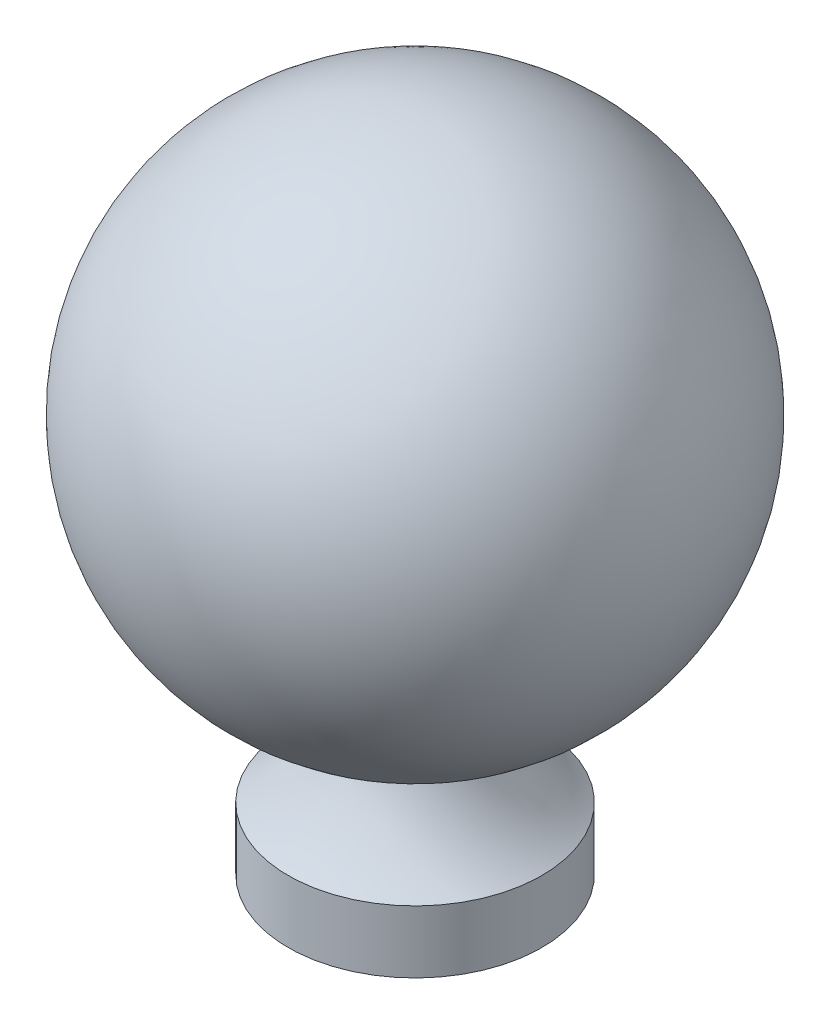
ISO-10303-21;
HEADER;
FILE_DESCRIPTION(('STEP AP214'),'2;1');
FILE_NAME('part.step','',(''),(''),'','','');
FILE_SCHEMA(('AUTOMOTIVE_DESIGN { 1 0 10303 214 1 1 1 1 }'));
ENDSEC;
DATA;
#1=APPLICATION_CONTEXT('core data for automotive mechanical design processes');
#2=APPLICATION_PROTOCOL_DEFINITION('international standard','automotive_design',2000,#1);
#3=PRODUCT_CONTEXT('',#1,'mechanical');
#4=PRODUCT('Part','Part','',(#3));
#5=PRODUCT_RELATED_PRODUCT_CATEGORY('part','',(#4));
#6=PRODUCT_DEFINITION_FORMATION('','',#4);
#7=PRODUCT_DEFINITION_CONTEXT('part definition',#1,'design');
#8=PRODUCT_DEFINITION('design','',#6,#7);
#9=PRODUCT_DEFINITION_SHAPE('','',#8);
#10=(LENGTH_UNIT() NAMED_UNIT(*) SI_UNIT(.MILLI.,.METRE.));
#11=(NAMED_UNIT(*) PLANE_ANGLE_UNIT() SI_UNIT($,.RADIAN.));
#12=(NAMED_UNIT(*) SI_UNIT($,.STERADIAN.) SOLID_ANGLE_UNIT());
#13=UNCERTAINTY_MEASURE_WITH_UNIT(LENGTH_MEASURE(1.E-05),#10,'distance_accuracy_value','');
#14=(GEOMETRIC_REPRESENTATION_CONTEXT(3) GLOBAL_UNCERTAINTY_ASSIGNED_CONTEXT((#13)) GLOBAL_UNIT_ASSIGNED_CONTEXT((#10,
#11,#12)) REPRESENTATION_CONTEXT('',''));
#15=CARTESIAN_POINT('',(0.,0.,0.));
#16=DIRECTION('',(0.,0.,1.));
#17=DIRECTION('',(1.,0.,0.));
#18=AXIS2_PLACEMENT_3D('',#15,#16,#17);
#19=CARTESIAN_POINT('',(0.,8.77,0.));
#20=DIRECTION('',(0.,-1.,0.));
#21=DIRECTION('',(1.,0.,0.));
#22=AXIS2_PLACEMENT_3D('',#19,#20,#21);
#23=SPHERICAL_SURFACE('',#22,5.75);
#24=CARTESIAN_POINT('',(0.,3.23626668356372,0.));
#25=DIRECTION('',(0.,-1.,0.));
#26=DIRECTION('',(0.,0.,-1.));
#27=AXIS2_PLACEMENT_3D('',#24,#25,#26);
#28=CIRCLE('',#27,1.56214454598897);
#29=CARTESIAN_POINT('',(0.,3.23626668356372,-1.56214454598897));
#30=VERTEX_POINT('',#29);
#31=EDGE_CURVE('E10',#30,#30,#28,.T.);
#32=ORIENTED_EDGE('',*,*,#31,.F.);
#33=EDGE_LOOP('',(#32));
#34=FACE_BOUND('',#33,.T.);
#35=ADVANCED_FACE('F31',(#34),#23,.T.);
#36=CARTESIAN_POINT('',(0.,3.18814726342079,0.));
#37=DIRECTION('',(0.,-1.,0.));
#38=DIRECTION('',(0.,0.,-1.));
#39=AXIS2_PLACEMENT_3D('',#36,#37,#38);
#40=TOROIDAL_SURFACE('',#39,1.57572841160626,0.05);
#41=ORIENTED_EDGE('',*,*,#31,.T.);
#42=EDGE_LOOP('',(#41));
#43=FACE_BOUND('',#42,.T.);
#44=CARTESIAN_POINT('',(0.,3.17239921063848,0.));
#45=DIRECTION('',(0.,-1.,0.));
#46=DIRECTION('',(0.,0.,-1.));
#47=AXIS2_PLACEMENT_3D('',#44,#45,#46);
#48=CIRCLE('',#47,1.52827318182528);
#49=CARTESIAN_POINT('',(0.,3.17239921063848,-1.52827318182528));
#50=VERTEX_POINT('',#49);
#51=EDGE_CURVE('E37',#50,#50,#48,.T.);
#52=ORIENTED_EDGE('',*,*,#51,.F.);
#53=EDGE_LOOP('',(#52));
#54=FACE_BOUND('',#53,.T.);
#55=ADVANCED_FACE('F63',(#43,#54),#40,.F.);
#56=CARTESIAN_POINT('',(0.,4.3692512220943,0.));
#57=DIRECTION('',(0.,-1.,0.));
#58=DIRECTION('',(0.,0.,-1.));
#59=AXIS2_PLACEMENT_3D('',#56,#57,#58);
#60=TOROIDAL_SURFACE('',#59,5.13487064517965,3.8);
#61=ORIENTED_EDGE('',*,*,#51,.T.);
#62=EDGE_LOOP('',(#61));
#63=FACE_BOUND('',#62,.T.);
#64=CARTESIAN_POINT('',(0.,1.37508934206401,0.));
#65=DIRECTION('',(0.,-1.,0.));
#66=DIRECTION('',(0.,0.,-1.));
#67=AXIS2_PLACEMENT_3D('',#64,#65,#66);
#68=CIRCLE('',#67,2.795);
#69=CARTESIAN_POINT('',(0.,1.37508934206401,-2.795));
#70=VERTEX_POINT('',#69);
#71=EDGE_CURVE('E41',#70,#70,#68,.T.);
#72=ORIENTED_EDGE('',*,*,#71,.F.);
#73=EDGE_LOOP('',(#72));
#74=FACE_BOUND('',#73,.T.);
#75=ADVANCED_FACE('F55',(#63,#74),#60,.F.);
#76=CARTESIAN_POINT('',(0.,0.,0.));
#77=DIRECTION('',(0.,-1.,0.));
#78=DIRECTION('',(0.,0.,-1.));
#79=AXIS2_PLACEMENT_3D('',#76,#77,#78);
#80=CYLINDRICAL_SURFACE('',#79,2.795);
#81=ORIENTED_EDGE('',*,*,#71,.T.);
#82=EDGE_LOOP('',(#81));
#83=FACE_BOUND('',#82,.T.);
#84=CARTESIAN_POINT('',(0.,0.,0.));
#85=DIRECTION('',(0.,-1.,0.));
#86=DIRECTION('',(0.,0.,-1.));
#87=AXIS2_PLACEMENT_3D('',#84,#85,#86);
#88=CIRCLE('',#87,2.795);
#89=CARTESIAN_POINT('',(0.,0.,-2.795));
#90=VERTEX_POINT('',#89);
#91=EDGE_CURVE('E45',#90,#90,#88,.T.);
#92=ORIENTED_EDGE('',*,*,#91,.F.);
#93=EDGE_LOOP('',(#92));
#94=FACE_BOUND('',#93,.T.);
#95=ADVANCED_FACE('F53',(#83,#94),#80,.T.);
#96=CARTESIAN_POINT('',(0.,0.,0.));
#97=DIRECTION('',(0.,-1.,0.));
#98=DIRECTION('',(0.,0.,-1.));
#99=AXIS2_PLACEMENT_3D('',#96,#97,#98);
#100=PLANE('',#99);
#101=ORIENTED_EDGE('',*,*,#91,.T.);
#102=EDGE_LOOP('',(#101));
#103=FACE_BOUND('',#102,.T.);
#104=ADVANCED_FACE('F51',(#103),#100,.T.);
#105=CLOSED_SHELL('',(#35,#55,#75,#95,#104));
#106=MANIFOLD_SOLID_BREP('B2',#105);
#107=ADVANCED_BREP_SHAPE_REPRESENTATION('',(#18,#106),#14);
#108=SHAPE_DEFINITION_REPRESENTATION(#9,#107);
ENDSEC;
END-ISO-10303-21;
